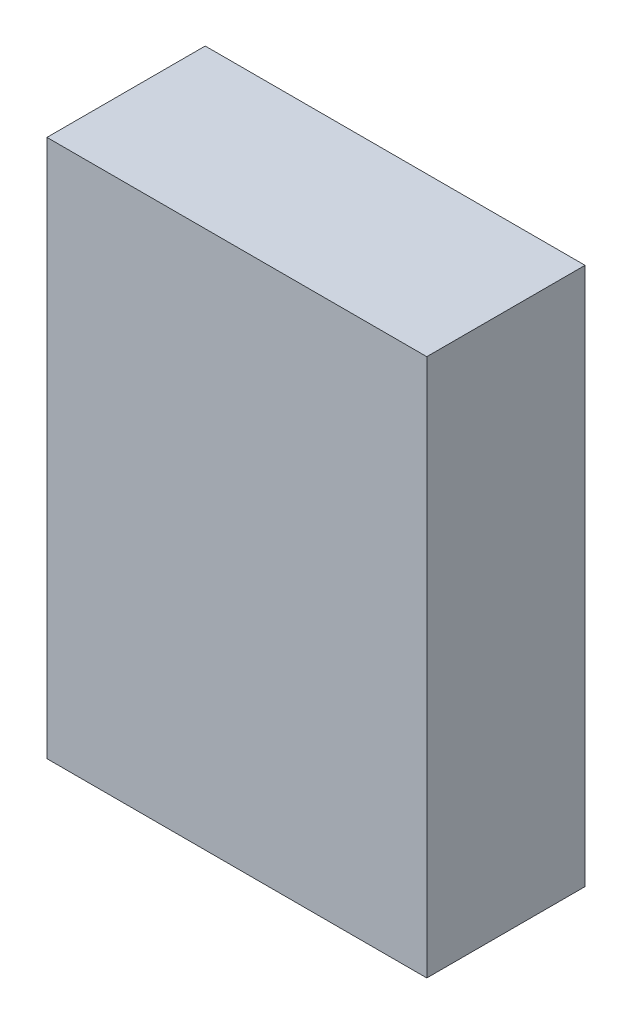
ISO-10303-21;
HEADER;
FILE_DESCRIPTION(('STEP AP214'),'2;1');
FILE_NAME('part.step','',(''),(''),'','','');
FILE_SCHEMA(('AUTOMOTIVE_DESIGN { 1 0 10303 214 1 1 1 1 }'));
ENDSEC;
DATA;
#1=APPLICATION_CONTEXT('core data for automotive mechanical design processes');
#2=APPLICATION_PROTOCOL_DEFINITION('international standard','automotive_design',2000,#1);
#3=PRODUCT_CONTEXT('',#1,'mechanical');
#4=PRODUCT('Part','Part','',(#3));
#5=PRODUCT_RELATED_PRODUCT_CATEGORY('part','',(#4));
#6=PRODUCT_DEFINITION_FORMATION('','',#4);
#7=PRODUCT_DEFINITION_CONTEXT('part definition',#1,'design');
#8=PRODUCT_DEFINITION('design','',#6,#7);
#9=PRODUCT_DEFINITION_SHAPE('','',#8);
#10=(LENGTH_UNIT() NAMED_UNIT(*) SI_UNIT(.MILLI.,.METRE.));
#11=(NAMED_UNIT(*) PLANE_ANGLE_UNIT() SI_UNIT($,.RADIAN.));
#12=(NAMED_UNIT(*) SI_UNIT($,.STERADIAN.) SOLID_ANGLE_UNIT());
#13=UNCERTAINTY_MEASURE_WITH_UNIT(LENGTH_MEASURE(1.E-05),#10,'distance_accuracy_value','');
#14=(GEOMETRIC_REPRESENTATION_CONTEXT(3) GLOBAL_UNCERTAINTY_ASSIGNED_CONTEXT((#13)) GLOBAL_UNIT_ASSIGNED_CONTEXT((#10,
#11,#12)) REPRESENTATION_CONTEXT('',''));
#15=CARTESIAN_POINT('',(0.,0.,0.));
#16=DIRECTION('',(0.,0.,1.));
#17=DIRECTION('',(1.,0.,0.));
#18=AXIS2_PLACEMENT_3D('',#15,#16,#17);
#19=CARTESIAN_POINT('',(-0.87,2.58,0.));
#20=DIRECTION('',(1.,0.,0.));
#21=DIRECTION('',(0.,0.,1.));
#22=AXIS2_PLACEMENT_3D('',#19,#20,#21);
#23=PLANE('',#22);
#24=DIRECTION('',(0.,1.,0.));
#25=VECTOR('',#24,1.);
#26=CARTESIAN_POINT('',(-0.87,2.58,0.1));
#27=LINE('',#26,#25);
#28=CARTESIAN_POINT('',(-0.87,2.58,0.1));
#29=VERTEX_POINT('',#28);
#30=CARTESIAN_POINT('',(-0.87,2.92,0.1));
#31=VERTEX_POINT('',#30);
#32=EDGE_CURVE('E11',#29,#31,#27,.T.);
#33=ORIENTED_EDGE('',*,*,#32,.T.);
#34=DIRECTION('',(0.,0.,1.));
#35=VECTOR('',#34,1.);
#36=CARTESIAN_POINT('',(-0.87,2.92,0.));
#37=LINE('',#36,#35);
#38=CARTESIAN_POINT('',(-0.87,2.92,0.));
#39=VERTEX_POINT('',#38);
#40=EDGE_CURVE('E24',#39,#31,#37,.T.);
#41=ORIENTED_EDGE('',*,*,#40,.F.);
#42=DIRECTION('',(0.,1.,0.));
#43=VECTOR('',#42,1.);
#44=CARTESIAN_POINT('',(-0.87,2.58,0.));
#45=LINE('',#44,#43);
#46=CARTESIAN_POINT('',(-0.87,2.58,0.));
#47=VERTEX_POINT('',#46);
#48=EDGE_CURVE('E86',#47,#39,#45,.T.);
#49=ORIENTED_EDGE('',*,*,#48,.F.);
#50=DIRECTION('',(0.,0.,1.));
#51=VECTOR('',#50,1.);
#52=CARTESIAN_POINT('',(-0.87,2.58,0.));
#53=LINE('',#52,#51);
#54=EDGE_CURVE('E36',#47,#29,#53,.T.);
#55=ORIENTED_EDGE('',*,*,#54,.T.);
#56=EDGE_LOOP('',(#33,#41,#49,#55));
#57=FACE_BOUND('',#56,.T.);
#58=ADVANCED_FACE('F17',(#57),#23,.F.);
#59=CARTESIAN_POINT('',(-0.63,2.58,0.));
#60=DIRECTION('',(1.,0.,0.));
#61=DIRECTION('',(0.,0.,1.));
#62=AXIS2_PLACEMENT_3D('',#59,#60,#61);
#63=PLANE('',#62);
#64=DIRECTION('',(0.,0.,1.));
#65=VECTOR('',#64,1.);
#66=CARTESIAN_POINT('',(-0.63,2.58,0.));
#67=LINE('',#66,#65);
#68=CARTESIAN_POINT('',(-0.63,2.58,0.));
#69=VERTEX_POINT('',#68);
#70=CARTESIAN_POINT('',(-0.63,2.58,0.1));
#71=VERTEX_POINT('',#70);
#72=EDGE_CURVE('E83',#69,#71,#67,.T.);
#73=ORIENTED_EDGE('',*,*,#72,.F.);
#74=DIRECTION('',(0.,1.,0.));
#75=VECTOR('',#74,1.);
#76=CARTESIAN_POINT('',(-0.63,2.58,0.));
#77=LINE('',#76,#75);
#78=CARTESIAN_POINT('',(-0.63,2.92,0.));
#79=VERTEX_POINT('',#78);
#80=EDGE_CURVE('E63',#69,#79,#77,.T.);
#81=ORIENTED_EDGE('',*,*,#80,.T.);
#82=DIRECTION('',(0.,0.,1.));
#83=VECTOR('',#82,1.);
#84=CARTESIAN_POINT('',(-0.63,2.92,0.));
#85=LINE('',#84,#83);
#86=CARTESIAN_POINT('',(-0.63,2.92,0.1));
#87=VERTEX_POINT('',#86);
#88=EDGE_CURVE('E57',#79,#87,#85,.T.);
#89=ORIENTED_EDGE('',*,*,#88,.T.);
#90=DIRECTION('',(0.,1.,0.));
#91=VECTOR('',#90,1.);
#92=CARTESIAN_POINT('',(-0.63,2.58,0.1));
#93=LINE('',#92,#91);
#94=EDGE_CURVE('E60',#71,#87,#93,.T.);
#95=ORIENTED_EDGE('',*,*,#94,.F.);
#96=EDGE_LOOP('',(#73,#81,#89,#95));
#97=FACE_BOUND('',#96,.T.);
#98=ADVANCED_FACE('F59',(#97),#63,.T.);
#99=CARTESIAN_POINT('',(-0.87,2.58,0.));
#100=DIRECTION('',(0.,1.,0.));
#101=DIRECTION('',(0.,0.,1.));
#102=AXIS2_PLACEMENT_3D('',#99,#100,#101);
#103=PLANE('',#102);
#104=ORIENTED_EDGE('',*,*,#72,.T.);
#105=DIRECTION('',(1.,0.,0.));
#106=VECTOR('',#105,1.);
#107=CARTESIAN_POINT('',(-0.87,2.58,0.1));
#108=LINE('',#107,#106);
#109=EDGE_CURVE('E71',#29,#71,#108,.T.);
#110=ORIENTED_EDGE('',*,*,#109,.F.);
#111=ORIENTED_EDGE('',*,*,#54,.F.);
#112=DIRECTION('',(1.,0.,0.));
#113=VECTOR('',#112,1.);
#114=CARTESIAN_POINT('',(-0.87,2.58,0.));
#115=LINE('',#114,#113);
#116=EDGE_CURVE('E76',#47,#69,#115,.T.);
#117=ORIENTED_EDGE('',*,*,#116,.T.);
#118=EDGE_LOOP('',(#104,#110,#111,#117));
#119=FACE_BOUND('',#118,.T.);
#120=ADVANCED_FACE('F91',(#119),#103,.F.);
#121=CARTESIAN_POINT('',(-0.87,2.92,0.));
#122=DIRECTION('',(0.,1.,0.));
#123=DIRECTION('',(0.,0.,1.));
#124=AXIS2_PLACEMENT_3D('',#121,#122,#123);
#125=PLANE('',#124);
#126=DIRECTION('',(1.,0.,0.));
#127=VECTOR('',#126,1.);
#128=CARTESIAN_POINT('',(-0.87,2.92,0.));
#129=LINE('',#128,#127);
#130=EDGE_CURVE('E74',#39,#79,#129,.T.);
#131=ORIENTED_EDGE('',*,*,#130,.F.);
#132=ORIENTED_EDGE('',*,*,#40,.T.);
#133=DIRECTION('',(1.,0.,0.));
#134=VECTOR('',#133,1.);
#135=CARTESIAN_POINT('',(-0.87,2.92,0.1));
#136=LINE('',#135,#134);
#137=EDGE_CURVE('E69',#31,#87,#136,.T.);
#138=ORIENTED_EDGE('',*,*,#137,.T.);
#139=ORIENTED_EDGE('',*,*,#88,.F.);
#140=EDGE_LOOP('',(#131,#132,#138,#139));
#141=FACE_BOUND('',#140,.T.);
#142=ADVANCED_FACE('F73',(#141),#125,.T.);
#143=CARTESIAN_POINT('',(-0.87,2.58,0.));
#144=DIRECTION('',(0.,0.,1.));
#145=DIRECTION('',(1.,0.,0.));
#146=AXIS2_PLACEMENT_3D('',#143,#144,#145);
#147=PLANE('',#146);
#148=ORIENTED_EDGE('',*,*,#130,.T.);
#149=ORIENTED_EDGE('',*,*,#80,.F.);
#150=ORIENTED_EDGE('',*,*,#116,.F.);
#151=ORIENTED_EDGE('',*,*,#48,.T.);
#152=EDGE_LOOP('',(#148,#149,#150,#151));
#153=FACE_BOUND('',#152,.T.);
#154=ADVANCED_FACE('F89',(#153),#147,.F.);
#155=CARTESIAN_POINT('',(-0.87,2.58,0.1));
#156=DIRECTION('',(0.,0.,1.));
#157=DIRECTION('',(1.,0.,0.));
#158=AXIS2_PLACEMENT_3D('',#155,#156,#157);
#159=PLANE('',#158);
#160=ORIENTED_EDGE('',*,*,#32,.F.);
#161=ORIENTED_EDGE('',*,*,#109,.T.);
#162=ORIENTED_EDGE('',*,*,#94,.T.);
#163=ORIENTED_EDGE('',*,*,#137,.F.);
#164=EDGE_LOOP('',(#160,#161,#162,#163));
#165=FACE_BOUND('',#164,.T.);
#166=ADVANCED_FACE('F68',(#165),#159,.T.);
#167=CLOSED_SHELL('',(#58,#98,#120,#142,#154,#166));
#168=MANIFOLD_SOLID_BREP('B1',#167);
#169=ADVANCED_BREP_SHAPE_REPRESENTATION('',(#18,#168),#14);
#170=SHAPE_DEFINITION_REPRESENTATION(#9,#169);
ENDSEC;
END-ISO-10303-21;
